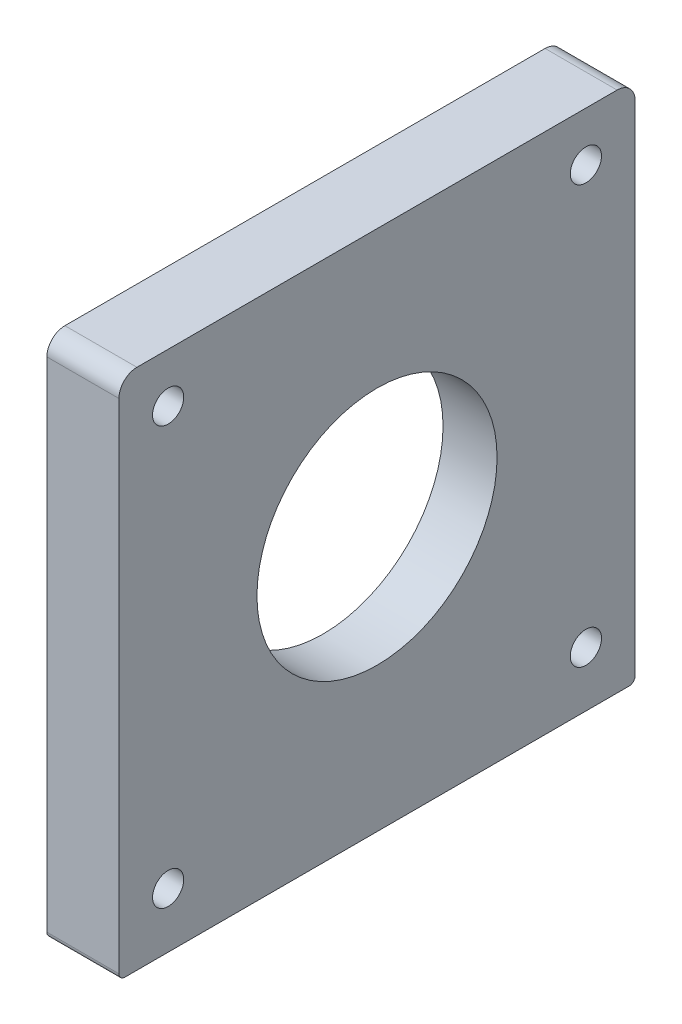
ISO-10303-21;
HEADER;
FILE_DESCRIPTION(('STEP AP214'),'2;1');
FILE_NAME('part.step','',(''),(''),'','','');
FILE_SCHEMA(('AUTOMOTIVE_DESIGN { 1 0 10303 214 1 1 1 1 }'));
ENDSEC;
DATA;
#1=APPLICATION_CONTEXT('core data for automotive mechanical design processes');
#2=APPLICATION_PROTOCOL_DEFINITION('international standard','automotive_design',2000,#1);
#3=PRODUCT_CONTEXT('',#1,'mechanical');
#4=PRODUCT('Part','Part','',(#3));
#5=PRODUCT_RELATED_PRODUCT_CATEGORY('part','',(#4));
#6=PRODUCT_DEFINITION_FORMATION('','',#4);
#7=PRODUCT_DEFINITION_CONTEXT('part definition',#1,'design');
#8=PRODUCT_DEFINITION('design','',#6,#7);
#9=PRODUCT_DEFINITION_SHAPE('','',#8);
#10=(LENGTH_UNIT() NAMED_UNIT(*) SI_UNIT(.MILLI.,.METRE.));
#11=(NAMED_UNIT(*) PLANE_ANGLE_UNIT() SI_UNIT($,.RADIAN.));
#12=(NAMED_UNIT(*) SI_UNIT($,.STERADIAN.) SOLID_ANGLE_UNIT());
#13=UNCERTAINTY_MEASURE_WITH_UNIT(LENGTH_MEASURE(1.E-05),#10,'distance_accuracy_value','');
#14=(GEOMETRIC_REPRESENTATION_CONTEXT(3) GLOBAL_UNCERTAINTY_ASSIGNED_CONTEXT((#13)) GLOBAL_UNIT_ASSIGNED_CONTEXT((#10,
#11,#12)) REPRESENTATION_CONTEXT('',''));
#15=CARTESIAN_POINT('',(0.,0.,0.));
#16=DIRECTION('',(0.,0.,1.));
#17=DIRECTION('',(1.,0.,0.));
#18=AXIS2_PLACEMENT_3D('',#15,#16,#17);
#19=CARTESIAN_POINT('',(0.,12.,86.));
#20=DIRECTION('',(0.,0.,-1.));
#21=DIRECTION('',(-1.,0.,0.));
#22=AXIS2_PLACEMENT_3D('',#19,#20,#21);
#23=PLANE('',#22);
#24=DIRECTION('',(0.,-1.,0.));
#25=VECTOR('',#24,1.);
#26=CARTESIAN_POINT('',(28.,99.,86.));
#27=LINE('',#26,#25);
#28=CARTESIAN_POINT('',(28.,96.,86.));
#29=VERTEX_POINT('',#28);
#30=CARTESIAN_POINT('',(28.,13.,86.));
#31=VERTEX_POINT('',#30);
#32=EDGE_CURVE('E136',#29,#31,#27,.T.);
#33=ORIENTED_EDGE('',*,*,#32,.T.);
#34=DIRECTION('',(-1.,0.,0.));
#35=VECTOR('',#34,1.);
#36=CARTESIAN_POINT('',(0.,13.,86.));
#37=LINE('',#36,#35);
#38=CARTESIAN_POINT('',(40.,13.,86.));
#39=VERTEX_POINT('',#38);
#40=EDGE_CURVE('E13',#31,#39,#37,.F.);
#41=ORIENTED_EDGE('',*,*,#40,.T.);
#42=DIRECTION('',(0.,-1.,0.));
#43=VECTOR('',#42,1.);
#44=CARTESIAN_POINT('',(40.,12.,86.));
#45=LINE('',#44,#43);
#46=CARTESIAN_POINT('',(40.,96.,86.));
#47=VERTEX_POINT('',#46);
#48=EDGE_CURVE('E152',#47,#39,#45,.T.);
#49=ORIENTED_EDGE('',*,*,#48,.F.);
#50=DIRECTION('',(1.,0.,0.));
#51=VECTOR('',#50,1.);
#52=CARTESIAN_POINT('',(0.,96.,86.));
#53=LINE('',#52,#51);
#54=EDGE_CURVE('E116',#47,#29,#53,.F.);
#55=ORIENTED_EDGE('',*,*,#54,.T.);
#56=EDGE_LOOP('',(#33,#41,#49,#55));
#57=FACE_BOUND('',#56,.T.);
#58=ADVANCED_FACE('F45',(#57),#23,.F.);
#59=CARTESIAN_POINT('',(40.,12.,0.));
#60=DIRECTION('',(-1.,0.,0.));
#61=DIRECTION('',(0.,0.,1.));
#62=AXIS2_PLACEMENT_3D('',#59,#60,#61);
#63=PLANE('',#62);
#64=CARTESIAN_POINT('',(40.,56.,43.));
#65=DIRECTION('',(-1.,0.,0.));
#66=DIRECTION('',(0.,0.,1.));
#67=AXIS2_PLACEMENT_3D('',#64,#65,#66);
#68=CIRCLE('',#67,20.);
#69=CARTESIAN_POINT('',(40.,56.,63.));
#70=VERTEX_POINT('',#69);
#71=EDGE_CURVE('E168',#70,#70,#68,.T.);
#72=ORIENTED_EDGE('',*,*,#71,.T.);
#73=EDGE_LOOP('',(#72));
#74=FACE_BOUND('',#73,.T.);
#75=CARTESIAN_POINT('',(40.,21.2,77.8));
#76=DIRECTION('',(-1.,0.,0.));
#77=DIRECTION('',(0.,0.,1.));
#78=AXIS2_PLACEMENT_3D('',#75,#76,#77);
#79=CIRCLE('',#78,2.6);
#80=CARTESIAN_POINT('',(40.,21.2,80.4));
#81=VERTEX_POINT('',#80);
#82=EDGE_CURVE('E336',#81,#81,#79,.T.);
#83=ORIENTED_EDGE('',*,*,#82,.T.);
#84=EDGE_LOOP('',(#83));
#85=FACE_BOUND('',#84,.T.);
#86=CARTESIAN_POINT('',(40.,90.8000000000001,8.19999999999999));
#87=DIRECTION('',(-1.,0.,0.));
#88=DIRECTION('',(0.,0.,1.));
#89=AXIS2_PLACEMENT_3D('',#86,#87,#88);
#90=CIRCLE('',#89,2.6);
#91=CARTESIAN_POINT('',(40.,90.8000000000001,10.8));
#92=VERTEX_POINT('',#91);
#93=EDGE_CURVE('E343',#92,#92,#90,.T.);
#94=ORIENTED_EDGE('',*,*,#93,.T.);
#95=EDGE_LOOP('',(#94));
#96=FACE_BOUND('',#95,.T.);
#97=CARTESIAN_POINT('',(40.,21.2000000000001,8.19999999999996));
#98=DIRECTION('',(-1.,0.,0.));
#99=DIRECTION('',(0.,0.,1.));
#100=AXIS2_PLACEMENT_3D('',#97,#98,#99);
#101=CIRCLE('',#100,2.6);
#102=CARTESIAN_POINT('',(40.,21.2000000000001,10.8));
#103=VERTEX_POINT('',#102);
#104=EDGE_CURVE('E349',#103,#103,#101,.T.);
#105=ORIENTED_EDGE('',*,*,#104,.T.);
#106=EDGE_LOOP('',(#105));
#107=FACE_BOUND('',#106,.T.);
#108=CARTESIAN_POINT('',(40.,90.8000000000001,77.8));
#109=DIRECTION('',(-1.,0.,0.));
#110=DIRECTION('',(0.,0.,1.));
#111=AXIS2_PLACEMENT_3D('',#108,#109,#110);
#112=CIRCLE('',#111,2.6);
#113=CARTESIAN_POINT('',(40.,90.8000000000001,80.4));
#114=VERTEX_POINT('',#113);
#115=EDGE_CURVE('E354',#114,#114,#112,.T.);
#116=ORIENTED_EDGE('',*,*,#115,.T.);
#117=EDGE_LOOP('',(#116));
#118=FACE_BOUND('',#117,.T.);
#119=DIRECTION('',(0.,0.,1.));
#120=VECTOR('',#119,1.);
#121=CARTESIAN_POINT('',(40.,12.,0.));
#122=LINE('',#121,#120);
#123=CARTESIAN_POINT('',(40.,12.,1.));
#124=VERTEX_POINT('',#123);
#125=CARTESIAN_POINT('',(40.,12.,85.));
#126=VERTEX_POINT('',#125);
#127=EDGE_CURVE('E181',#124,#126,#122,.T.);
#128=ORIENTED_EDGE('',*,*,#127,.F.);
#129=CARTESIAN_POINT('',(40.,13.,1.));
#130=DIRECTION('',(-1.,0.,0.));
#131=DIRECTION('',(0.,0.,1.));
#132=AXIS2_PLACEMENT_3D('',#129,#130,#131);
#133=CIRCLE('',#132,1.);
#134=CARTESIAN_POINT('',(40.,13.,0.));
#135=VERTEX_POINT('',#134);
#136=EDGE_CURVE('E53',#124,#135,#133,.F.);
#137=ORIENTED_EDGE('',*,*,#136,.T.);
#138=DIRECTION('',(0.,-1.,0.));
#139=VECTOR('',#138,1.);
#140=CARTESIAN_POINT('',(40.,12.,0.));
#141=LINE('',#140,#139);
#142=CARTESIAN_POINT('',(40.,96.,0.));
#143=VERTEX_POINT('',#142);
#144=EDGE_CURVE('E149',#143,#135,#141,.T.);
#145=ORIENTED_EDGE('',*,*,#144,.F.);
#146=CARTESIAN_POINT('',(40.,96.,3.));
#147=DIRECTION('',(-1.,0.,0.));
#148=DIRECTION('',(0.,0.,1.));
#149=AXIS2_PLACEMENT_3D('',#146,#147,#148);
#150=CIRCLE('',#149,3.);
#151=CARTESIAN_POINT('',(40.,99.,3.));
#152=VERTEX_POINT('',#151);
#153=EDGE_CURVE('E118',#143,#152,#150,.F.);
#154=ORIENTED_EDGE('',*,*,#153,.T.);
#155=DIRECTION('',(0.,0.,-1.));
#156=VECTOR('',#155,1.);
#157=CARTESIAN_POINT('',(40.,99.,0.));
#158=LINE('',#157,#156);
#159=CARTESIAN_POINT('',(40.,99.,83.));
#160=VERTEX_POINT('',#159);
#161=EDGE_CURVE('E125',#160,#152,#158,.T.);
#162=ORIENTED_EDGE('',*,*,#161,.F.);
#163=CARTESIAN_POINT('',(40.,96.,83.));
#164=DIRECTION('',(-1.,0.,0.));
#165=DIRECTION('',(0.,0.,1.));
#166=AXIS2_PLACEMENT_3D('',#163,#164,#165);
#167=CIRCLE('',#166,3.);
#168=EDGE_CURVE('E111',#160,#47,#167,.F.);
#169=ORIENTED_EDGE('',*,*,#168,.T.);
#170=ORIENTED_EDGE('',*,*,#48,.T.);
#171=CARTESIAN_POINT('',(40.,13.,85.));
#172=DIRECTION('',(-1.,0.,0.));
#173=DIRECTION('',(0.,0.,1.));
#174=AXIS2_PLACEMENT_3D('',#171,#172,#173);
#175=CIRCLE('',#174,1.);
#176=EDGE_CURVE('E65',#39,#126,#175,.F.);
#177=ORIENTED_EDGE('',*,*,#176,.T.);
#178=EDGE_LOOP('',(#128,#137,#145,#154,#162,#169,#170,#177));
#179=FACE_BOUND('',#178,.T.);
#180=ADVANCED_FACE('F131',(#74,#85,#96,#107,#118,#179),#63,.F.);
#181=CARTESIAN_POINT('',(0.,12.,0.));
#182=DIRECTION('',(0.,0.,1.));
#183=DIRECTION('',(1.,0.,0.));
#184=AXIS2_PLACEMENT_3D('',#181,#182,#183);
#185=PLANE('',#184);
#186=ORIENTED_EDGE('',*,*,#144,.T.);
#187=DIRECTION('',(-1.,0.,0.));
#188=VECTOR('',#187,1.);
#189=CARTESIAN_POINT('',(0.,13.,0.));
#190=LINE('',#189,#188);
#191=CARTESIAN_POINT('',(28.,13.,0.));
#192=VERTEX_POINT('',#191);
#193=EDGE_CURVE('E163',#135,#192,#190,.T.);
#194=ORIENTED_EDGE('',*,*,#193,.T.);
#195=DIRECTION('',(0.,-1.,0.));
#196=VECTOR('',#195,1.);
#197=CARTESIAN_POINT('',(28.,99.,0.));
#198=LINE('',#197,#196);
#199=CARTESIAN_POINT('',(28.,96.,0.));
#200=VERTEX_POINT('',#199);
#201=EDGE_CURVE('E146',#200,#192,#198,.T.);
#202=ORIENTED_EDGE('',*,*,#201,.F.);
#203=DIRECTION('',(-1.,0.,0.));
#204=VECTOR('',#203,1.);
#205=CARTESIAN_POINT('',(0.,96.,0.));
#206=LINE('',#205,#204);
#207=EDGE_CURVE('E161',#200,#143,#206,.F.);
#208=ORIENTED_EDGE('',*,*,#207,.T.);
#209=EDGE_LOOP('',(#186,#194,#202,#208));
#210=FACE_BOUND('',#209,.T.);
#211=ADVANCED_FACE('F186',(#210),#185,.F.);
#212=CARTESIAN_POINT('',(28.,99.,0.));
#213=DIRECTION('',(1.,0.,0.));
#214=DIRECTION('',(0.,0.,-1.));
#215=AXIS2_PLACEMENT_3D('',#212,#213,#214);
#216=PLANE('',#215);
#217=CARTESIAN_POINT('',(28.,21.2,77.8));
#218=DIRECTION('',(-1.,0.,0.));
#219=DIRECTION('',(0.,0.,1.));
#220=AXIS2_PLACEMENT_3D('',#217,#218,#219);
#221=CIRCLE('',#220,2.6);
#222=CARTESIAN_POINT('',(28.,21.2,80.4));
#223=VERTEX_POINT('',#222);
#224=EDGE_CURVE('E340',#223,#223,#221,.T.);
#225=ORIENTED_EDGE('',*,*,#224,.F.);
#226=EDGE_LOOP('',(#225));
#227=FACE_BOUND('',#226,.T.);
#228=CARTESIAN_POINT('',(28.,90.8000000000001,8.19999999999999));
#229=DIRECTION('',(-1.,0.,0.));
#230=DIRECTION('',(0.,0.,1.));
#231=AXIS2_PLACEMENT_3D('',#228,#229,#230);
#232=CIRCLE('',#231,2.6);
#233=CARTESIAN_POINT('',(28.,90.8000000000001,10.8));
#234=VERTEX_POINT('',#233);
#235=EDGE_CURVE('E346',#234,#234,#232,.T.);
#236=ORIENTED_EDGE('',*,*,#235,.F.);
#237=EDGE_LOOP('',(#236));
#238=FACE_BOUND('',#237,.T.);
#239=CARTESIAN_POINT('',(28.,21.2000000000001,8.19999999999996));
#240=DIRECTION('',(-1.,0.,0.));
#241=DIRECTION('',(0.,0.,1.));
#242=AXIS2_PLACEMENT_3D('',#239,#240,#241);
#243=CIRCLE('',#242,2.6);
#244=CARTESIAN_POINT('',(28.,21.2000000000001,10.8));
#245=VERTEX_POINT('',#244);
#246=EDGE_CURVE('E167',#245,#245,#243,.T.);
#247=ORIENTED_EDGE('',*,*,#246,.F.);
#248=EDGE_LOOP('',(#247));
#249=FACE_BOUND('',#248,.T.);
#250=CARTESIAN_POINT('',(28.,90.8000000000001,77.8));
#251=DIRECTION('',(-1.,0.,0.));
#252=DIRECTION('',(0.,0.,1.));
#253=AXIS2_PLACEMENT_3D('',#250,#251,#252);
#254=CIRCLE('',#253,2.6);
#255=CARTESIAN_POINT('',(28.,90.8000000000001,80.4));
#256=VERTEX_POINT('',#255);
#257=EDGE_CURVE('E339',#256,#256,#254,.T.);
#258=ORIENTED_EDGE('',*,*,#257,.F.);
#259=EDGE_LOOP('',(#258));
#260=FACE_BOUND('',#259,.T.);
#261=CARTESIAN_POINT('',(28.,56.,43.));
#262=DIRECTION('',(-1.,0.,0.));
#263=DIRECTION('',(0.,0.,1.));
#264=AXIS2_PLACEMENT_3D('',#261,#262,#263);
#265=CIRCLE('',#264,38.);
#266=CARTESIAN_POINT('',(28.,56.,81.));
#267=VERTEX_POINT('',#266);
#268=EDGE_CURVE('E142',#267,#267,#265,.T.);
#269=ORIENTED_EDGE('',*,*,#268,.F.);
#270=EDGE_LOOP('',(#269));
#271=FACE_BOUND('',#270,.T.);
#272=ORIENTED_EDGE('',*,*,#201,.T.);
#273=CARTESIAN_POINT('',(28.,13.,1.));
#274=DIRECTION('',(1.,0.,0.));
#275=DIRECTION('',(0.,0.,-1.));
#276=AXIS2_PLACEMENT_3D('',#273,#274,#275);
#277=CIRCLE('',#276,1.);
#278=CARTESIAN_POINT('',(28.,12.,1.));
#279=VERTEX_POINT('',#278);
#280=EDGE_CURVE('E173',#192,#279,#277,.F.);
#281=ORIENTED_EDGE('',*,*,#280,.T.);
#282=DIRECTION('',(0.,0.,1.));
#283=VECTOR('',#282,1.);
#284=CARTESIAN_POINT('',(28.,12.,0.));
#285=LINE('',#284,#283);
#286=CARTESIAN_POINT('',(28.,12.,85.));
#287=VERTEX_POINT('',#286);
#288=EDGE_CURVE('E134',#279,#287,#285,.T.);
#289=ORIENTED_EDGE('',*,*,#288,.T.);
#290=CARTESIAN_POINT('',(28.,13.,85.));
#291=DIRECTION('',(1.,0.,0.));
#292=DIRECTION('',(0.,0.,-1.));
#293=AXIS2_PLACEMENT_3D('',#290,#291,#292);
#294=CIRCLE('',#293,1.);
#295=EDGE_CURVE('E171',#287,#31,#294,.F.);
#296=ORIENTED_EDGE('',*,*,#295,.T.);
#297=ORIENTED_EDGE('',*,*,#32,.F.);
#298=CARTESIAN_POINT('',(28.,96.,83.));
#299=DIRECTION('',(1.,0.,0.));
#300=DIRECTION('',(0.,0.,-1.));
#301=AXIS2_PLACEMENT_3D('',#298,#299,#300);
#302=CIRCLE('',#301,3.);
#303=CARTESIAN_POINT('',(28.,99.,83.));
#304=VERTEX_POINT('',#303);
#305=EDGE_CURVE('E159',#29,#304,#302,.F.);
#306=ORIENTED_EDGE('',*,*,#305,.T.);
#307=DIRECTION('',(0.,0.,1.));
#308=VECTOR('',#307,1.);
#309=CARTESIAN_POINT('',(28.,99.,0.));
#310=LINE('',#309,#308);
#311=CARTESIAN_POINT('',(28.,99.,3.));
#312=VERTEX_POINT('',#311);
#313=EDGE_CURVE('E128',#312,#304,#310,.T.);
#314=ORIENTED_EDGE('',*,*,#313,.F.);
#315=CARTESIAN_POINT('',(28.,96.,3.));
#316=DIRECTION('',(1.,0.,0.));
#317=DIRECTION('',(0.,0.,-1.));
#318=AXIS2_PLACEMENT_3D('',#315,#316,#317);
#319=CIRCLE('',#318,3.);
#320=EDGE_CURVE('E157',#312,#200,#319,.F.);
#321=ORIENTED_EDGE('',*,*,#320,.T.);
#322=EDGE_LOOP('',(#272,#281,#289,#296,#297,#306,#314,#321));
#323=FACE_BOUND('',#322,.T.);
#324=ADVANCED_FACE('F192',(#227,#238,#249,#260,#271,#323),#216,.F.);
#325=CARTESIAN_POINT('',(0.,99.,0.));
#326=DIRECTION('',(0.,-1.,0.));
#327=DIRECTION('',(0.,0.,-1.));
#328=AXIS2_PLACEMENT_3D('',#325,#326,#327);
#329=PLANE('',#328);
#330=ORIENTED_EDGE('',*,*,#313,.T.);
#331=DIRECTION('',(1.,0.,0.));
#332=VECTOR('',#331,1.);
#333=CARTESIAN_POINT('',(0.,99.,83.));
#334=LINE('',#333,#332);
#335=EDGE_CURVE('E115',#304,#160,#334,.T.);
#336=ORIENTED_EDGE('',*,*,#335,.T.);
#337=ORIENTED_EDGE('',*,*,#161,.T.);
#338=DIRECTION('',(-1.,0.,0.));
#339=VECTOR('',#338,1.);
#340=CARTESIAN_POINT('',(0.,99.,3.));
#341=LINE('',#340,#339);
#342=EDGE_CURVE('E129',#152,#312,#341,.T.);
#343=ORIENTED_EDGE('',*,*,#342,.T.);
#344=EDGE_LOOP('',(#330,#336,#337,#343));
#345=FACE_BOUND('',#344,.T.);
#346=ADVANCED_FACE('F123',(#345),#329,.F.);
#347=CARTESIAN_POINT('',(31.,56.,43.));
#348=DIRECTION('',(-1.,0.,0.));
#349=DIRECTION('',(0.,0.,1.));
#350=AXIS2_PLACEMENT_3D('',#347,#348,#349);
#351=CYLINDRICAL_SURFACE('',#350,38.);
#352=CARTESIAN_POINT('',(31.,56.,43.));
#353=DIRECTION('',(-1.,0.,0.));
#354=DIRECTION('',(0.,0.,1.));
#355=AXIS2_PLACEMENT_3D('',#352,#353,#354);
#356=CIRCLE('',#355,38.);
#357=CARTESIAN_POINT('',(31.,56.,81.));
#358=VERTEX_POINT('',#357);
#359=EDGE_CURVE('E139',#358,#358,#356,.T.);
#360=ORIENTED_EDGE('',*,*,#359,.F.);
#361=EDGE_LOOP('',(#360));
#362=FACE_BOUND('',#361,.T.);
#363=ORIENTED_EDGE('',*,*,#268,.T.);
#364=EDGE_LOOP('',(#363));
#365=FACE_BOUND('',#364,.T.);
#366=ADVANCED_FACE('F253',(#362,#365),#351,.F.);
#367=CARTESIAN_POINT('',(31.,56.,43.));
#368=DIRECTION('',(-1.,0.,0.));
#369=DIRECTION('',(0.,0.,1.));
#370=AXIS2_PLACEMENT_3D('',#367,#368,#369);
#371=PLANE('',#370);
#372=CARTESIAN_POINT('',(31.,56.,43.));
#373=DIRECTION('',(-1.,0.,0.));
#374=DIRECTION('',(0.,0.,1.));
#375=AXIS2_PLACEMENT_3D('',#372,#373,#374);
#376=CIRCLE('',#375,20.);
#377=CARTESIAN_POINT('',(31.,56.,63.));
#378=VERTEX_POINT('',#377);
#379=EDGE_CURVE('E164',#378,#378,#376,.T.);
#380=ORIENTED_EDGE('',*,*,#379,.F.);
#381=EDGE_LOOP('',(#380));
#382=FACE_BOUND('',#381,.T.);
#383=ORIENTED_EDGE('',*,*,#359,.T.);
#384=EDGE_LOOP('',(#383));
#385=FACE_BOUND('',#384,.T.);
#386=ADVANCED_FACE('F249',(#382,#385),#371,.T.);
#387=CARTESIAN_POINT('',(40.,90.8000000000001,77.8));
#388=DIRECTION('',(-1.,0.,0.));
#389=DIRECTION('',(0.,0.,1.));
#390=AXIS2_PLACEMENT_3D('',#387,#388,#389);
#391=CYLINDRICAL_SURFACE('',#390,2.6);
#392=ORIENTED_EDGE('',*,*,#115,.F.);
#393=EDGE_LOOP('',(#392));
#394=FACE_BOUND('',#393,.T.);
#395=ORIENTED_EDGE('',*,*,#257,.T.);
#396=EDGE_LOOP('',(#395));
#397=FACE_BOUND('',#396,.T.);
#398=ADVANCED_FACE('F245',(#394,#397),#391,.F.);
#399=CARTESIAN_POINT('',(40.,21.2000000000001,8.19999999999996));
#400=DIRECTION('',(-1.,0.,0.));
#401=DIRECTION('',(0.,0.,1.));
#402=AXIS2_PLACEMENT_3D('',#399,#400,#401);
#403=CYLINDRICAL_SURFACE('',#402,2.6);
#404=ORIENTED_EDGE('',*,*,#104,.F.);
#405=EDGE_LOOP('',(#404));
#406=FACE_BOUND('',#405,.T.);
#407=ORIENTED_EDGE('',*,*,#246,.T.);
#408=EDGE_LOOP('',(#407));
#409=FACE_BOUND('',#408,.T.);
#410=ADVANCED_FACE('F241',(#406,#409),#403,.F.);
#411=CARTESIAN_POINT('',(40.,90.8000000000001,8.19999999999999));
#412=DIRECTION('',(-1.,0.,0.));
#413=DIRECTION('',(0.,0.,1.));
#414=AXIS2_PLACEMENT_3D('',#411,#412,#413);
#415=CYLINDRICAL_SURFACE('',#414,2.6);
#416=ORIENTED_EDGE('',*,*,#93,.F.);
#417=EDGE_LOOP('',(#416));
#418=FACE_BOUND('',#417,.T.);
#419=ORIENTED_EDGE('',*,*,#235,.T.);
#420=EDGE_LOOP('',(#419));
#421=FACE_BOUND('',#420,.T.);
#422=ADVANCED_FACE('F237',(#418,#421),#415,.F.);
#423=CARTESIAN_POINT('',(40.,21.2,77.8));
#424=DIRECTION('',(-1.,0.,0.));
#425=DIRECTION('',(0.,0.,1.));
#426=AXIS2_PLACEMENT_3D('',#423,#424,#425);
#427=CYLINDRICAL_SURFACE('',#426,2.6);
#428=ORIENTED_EDGE('',*,*,#82,.F.);
#429=EDGE_LOOP('',(#428));
#430=FACE_BOUND('',#429,.T.);
#431=ORIENTED_EDGE('',*,*,#224,.T.);
#432=EDGE_LOOP('',(#431));
#433=FACE_BOUND('',#432,.T.);
#434=ADVANCED_FACE('F211',(#430,#433),#427,.F.);
#435=CARTESIAN_POINT('',(0.,96.,83.));
#436=DIRECTION('',(1.,0.,0.));
#437=DIRECTION('',(0.,0.,-1.));
#438=AXIS2_PLACEMENT_3D('',#435,#436,#437);
#439=CYLINDRICAL_SURFACE('',#438,3.);
#440=ORIENTED_EDGE('',*,*,#305,.F.);
#441=ORIENTED_EDGE('',*,*,#54,.F.);
#442=ORIENTED_EDGE('',*,*,#168,.F.);
#443=ORIENTED_EDGE('',*,*,#335,.F.);
#444=EDGE_LOOP('',(#440,#441,#442,#443));
#445=FACE_BOUND('',#444,.T.);
#446=ADVANCED_FACE('F114',(#445),#439,.T.);
#447=CARTESIAN_POINT('',(0.,96.,3.));
#448=DIRECTION('',(-1.,0.,0.));
#449=DIRECTION('',(0.,0.,1.));
#450=AXIS2_PLACEMENT_3D('',#447,#448,#449);
#451=CYLINDRICAL_SURFACE('',#450,3.);
#452=ORIENTED_EDGE('',*,*,#153,.F.);
#453=ORIENTED_EDGE('',*,*,#207,.F.);
#454=ORIENTED_EDGE('',*,*,#320,.F.);
#455=ORIENTED_EDGE('',*,*,#342,.F.);
#456=EDGE_LOOP('',(#452,#453,#454,#455));
#457=FACE_BOUND('',#456,.T.);
#458=ADVANCED_FACE('F210',(#457),#451,.T.);
#459=CARTESIAN_POINT('',(40.,56.,43.));
#460=DIRECTION('',(-1.,0.,0.));
#461=DIRECTION('',(0.,0.,1.));
#462=AXIS2_PLACEMENT_3D('',#459,#460,#461);
#463=CYLINDRICAL_SURFACE('',#462,20.);
#464=ORIENTED_EDGE('',*,*,#379,.T.);
#465=EDGE_LOOP('',(#464));
#466=FACE_BOUND('',#465,.T.);
#467=ORIENTED_EDGE('',*,*,#71,.F.);
#468=EDGE_LOOP('',(#467));
#469=FACE_BOUND('',#468,.T.);
#470=ADVANCED_FACE('F213',(#466,#469),#463,.F.);
#471=CARTESIAN_POINT('',(40.,12.,0.));
#472=DIRECTION('',(0.,1.,0.));
#473=DIRECTION('',(0.,0.,1.));
#474=AXIS2_PLACEMENT_3D('',#471,#472,#473);
#475=PLANE('',#474);
#476=CARTESIAN_POINT('',(34.0000000000031,12.,16.));
#477=DIRECTION('',(0.,-1.,0.));
#478=DIRECTION('',(0.,0.,-1.));
#479=AXIS2_PLACEMENT_3D('',#476,#477,#478);
#480=CIRCLE('',#479,2.1);
#481=CARTESIAN_POINT('',(34.0000000000031,12.,13.9));
#482=VERTEX_POINT('',#481);
#483=EDGE_CURVE('E323',#482,#482,#480,.T.);
#484=ORIENTED_EDGE('',*,*,#483,.F.);
#485=EDGE_LOOP('',(#484));
#486=FACE_BOUND('',#485,.T.);
#487=CARTESIAN_POINT('',(34.0000000000031,12.,70.));
#488=DIRECTION('',(0.,-1.,0.));
#489=DIRECTION('',(0.,0.,-1.));
#490=AXIS2_PLACEMENT_3D('',#487,#488,#489);
#491=CIRCLE('',#490,2.1);
#492=CARTESIAN_POINT('',(34.0000000000031,12.,67.9));
#493=VERTEX_POINT('',#492);
#494=EDGE_CURVE('E322',#493,#493,#491,.T.);
#495=ORIENTED_EDGE('',*,*,#494,.F.);
#496=EDGE_LOOP('',(#495));
#497=FACE_BOUND('',#496,.T.);
#498=ORIENTED_EDGE('',*,*,#288,.F.);
#499=DIRECTION('',(-1.,0.,0.));
#500=VECTOR('',#499,1.);
#501=CARTESIAN_POINT('',(40.,12.,1.));
#502=LINE('',#501,#500);
#503=EDGE_CURVE('E178',#279,#124,#502,.F.);
#504=ORIENTED_EDGE('',*,*,#503,.T.);
#505=ORIENTED_EDGE('',*,*,#127,.T.);
#506=DIRECTION('',(-1.,0.,0.));
#507=VECTOR('',#506,1.);
#508=CARTESIAN_POINT('',(40.,12.,85.));
#509=LINE('',#508,#507);
#510=EDGE_CURVE('E175',#126,#287,#509,.T.);
#511=ORIENTED_EDGE('',*,*,#510,.T.);
#512=EDGE_LOOP('',(#498,#504,#505,#511));
#513=FACE_BOUND('',#512,.T.);
#514=ADVANCED_FACE('F194',(#486,#497,#513),#475,.F.);
#515=CARTESIAN_POINT('',(0.,13.,1.));
#516=DIRECTION('',(-1.,0.,0.));
#517=DIRECTION('',(0.,0.,1.));
#518=AXIS2_PLACEMENT_3D('',#515,#516,#517);
#519=CYLINDRICAL_SURFACE('',#518,1.);
#520=ORIENTED_EDGE('',*,*,#136,.F.);
#521=ORIENTED_EDGE('',*,*,#503,.F.);
#522=ORIENTED_EDGE('',*,*,#280,.F.);
#523=ORIENTED_EDGE('',*,*,#193,.F.);
#524=EDGE_LOOP('',(#520,#521,#522,#523));
#525=FACE_BOUND('',#524,.T.);
#526=ADVANCED_FACE('F189',(#525),#519,.T.);
#527=CARTESIAN_POINT('',(40.,13.,85.));
#528=DIRECTION('',(-1.,0.,0.));
#529=DIRECTION('',(0.,0.,1.));
#530=AXIS2_PLACEMENT_3D('',#527,#528,#529);
#531=CYLINDRICAL_SURFACE('',#530,1.);
#532=ORIENTED_EDGE('',*,*,#176,.F.);
#533=ORIENTED_EDGE('',*,*,#40,.F.);
#534=ORIENTED_EDGE('',*,*,#295,.F.);
#535=ORIENTED_EDGE('',*,*,#510,.F.);
#536=EDGE_LOOP('',(#532,#533,#534,#535));
#537=FACE_BOUND('',#536,.T.);
#538=ADVANCED_FACE('F47',(#537),#531,.T.);
#539=CARTESIAN_POINT('',(34.0000000000031,24.,70.));
#540=DIRECTION('',(0.,-1.,0.));
#541=DIRECTION('',(0.,0.,-1.));
#542=AXIS2_PLACEMENT_3D('',#539,#540,#541);
#543=CYLINDRICAL_SURFACE('',#542,2.1);
#544=CARTESIAN_POINT('',(34.0000000000031,24.,70.));
#545=DIRECTION('',(0.,-1.,0.));
#546=DIRECTION('',(0.,0.,-1.));
#547=AXIS2_PLACEMENT_3D('',#544,#545,#546);
#548=CIRCLE('',#547,2.1);
#549=CARTESIAN_POINT('',(34.0000000000031,24.,67.9));
#550=VERTEX_POINT('',#549);
#551=EDGE_CURVE('E326',#550,#550,#548,.T.);
#552=ORIENTED_EDGE('',*,*,#551,.F.);
#553=EDGE_LOOP('',(#552));
#554=FACE_BOUND('',#553,.T.);
#555=ORIENTED_EDGE('',*,*,#494,.T.);
#556=EDGE_LOOP('',(#555));
#557=FACE_BOUND('',#556,.T.);
#558=ADVANCED_FACE('F220',(#554,#557),#543,.F.);
#559=CARTESIAN_POINT('',(34.0000000000031,24.,70.));
#560=DIRECTION('',(0.,-1.,0.));
#561=DIRECTION('',(0.,0.,-1.));
#562=AXIS2_PLACEMENT_3D('',#559,#560,#561);
#563=PLANE('',#562);
#564=ORIENTED_EDGE('',*,*,#551,.T.);
#565=EDGE_LOOP('',(#564));
#566=FACE_BOUND('',#565,.T.);
#567=ADVANCED_FACE('F287',(#566),#563,.T.);
#568=CARTESIAN_POINT('',(34.0000000000031,24.,16.));
#569=DIRECTION('',(0.,-1.,0.));
#570=DIRECTION('',(0.,0.,-1.));
#571=AXIS2_PLACEMENT_3D('',#568,#569,#570);
#572=CYLINDRICAL_SURFACE('',#571,2.1);
#573=CARTESIAN_POINT('',(34.0000000000031,24.,16.));
#574=DIRECTION('',(0.,-1.,0.));
#575=DIRECTION('',(0.,0.,-1.));
#576=AXIS2_PLACEMENT_3D('',#573,#574,#575);
#577=CIRCLE('',#576,2.1);
#578=CARTESIAN_POINT('',(34.0000000000031,24.,13.9));
#579=VERTEX_POINT('',#578);
#580=EDGE_CURVE('E321',#579,#579,#577,.T.);
#581=ORIENTED_EDGE('',*,*,#580,.F.);
#582=EDGE_LOOP('',(#581));
#583=FACE_BOUND('',#582,.T.);
#584=ORIENTED_EDGE('',*,*,#483,.T.);
#585=EDGE_LOOP('',(#584));
#586=FACE_BOUND('',#585,.T.);
#587=ADVANCED_FACE('F293',(#583,#586),#572,.F.);
#588=CARTESIAN_POINT('',(34.0000000000031,24.,16.));
#589=DIRECTION('',(0.,-1.,0.));
#590=DIRECTION('',(0.,0.,-1.));
#591=AXIS2_PLACEMENT_3D('',#588,#589,#590);
#592=PLANE('',#591);
#593=ORIENTED_EDGE('',*,*,#580,.T.);
#594=EDGE_LOOP('',(#593));
#595=FACE_BOUND('',#594,.T.);
#596=ADVANCED_FACE('F300',(#595),#592,.T.);
#597=CLOSED_SHELL('',(#58,#180,#211,#324,#346,#366,#386,#398,#410,#422,#434,#446,#458,#470,#514,
#526,#538,#558,#567,#587,#596));
#598=MANIFOLD_SOLID_BREP('B2',#597);
#599=ADVANCED_BREP_SHAPE_REPRESENTATION('',(#18,#598),#14);
#600=SHAPE_DEFINITION_REPRESENTATION(#9,#599);
ENDSEC;
END-ISO-10303-21;
